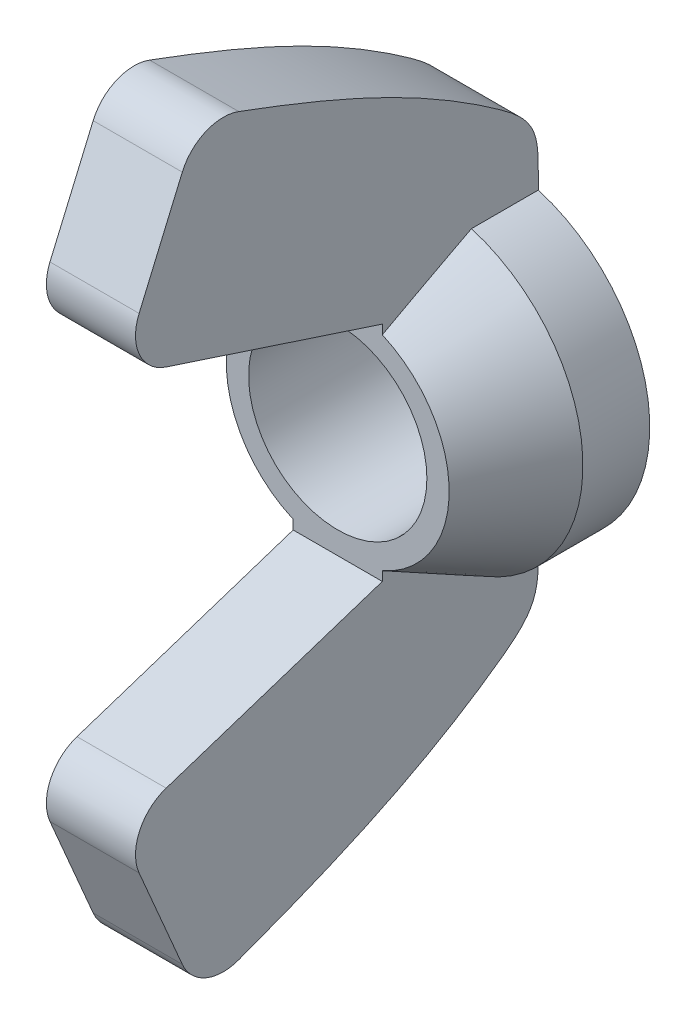
ISO-10303-21;
HEADER;
FILE_DESCRIPTION(('STEP AP214'),'2;1');
FILE_NAME('part.step','',(''),(''),'','','');
FILE_SCHEMA(('AUTOMOTIVE_DESIGN { 1 0 10303 214 1 1 1 1 }'));
ENDSEC;
DATA;
#1=APPLICATION_CONTEXT('core data for automotive mechanical design processes');
#2=APPLICATION_PROTOCOL_DEFINITION('international standard','automotive_design',2000,#1);
#3=PRODUCT_CONTEXT('',#1,'mechanical');
#4=PRODUCT('Part','Part','',(#3));
#5=PRODUCT_RELATED_PRODUCT_CATEGORY('part','',(#4));
#6=PRODUCT_DEFINITION_FORMATION('','',#4);
#7=PRODUCT_DEFINITION_CONTEXT('part definition',#1,'design');
#8=PRODUCT_DEFINITION('design','',#6,#7);
#9=PRODUCT_DEFINITION_SHAPE('','',#8);
#10=(LENGTH_UNIT() NAMED_UNIT(*) SI_UNIT(.MILLI.,.METRE.));
#11=(NAMED_UNIT(*) PLANE_ANGLE_UNIT() SI_UNIT($,.RADIAN.));
#12=(NAMED_UNIT(*) SI_UNIT($,.STERADIAN.) SOLID_ANGLE_UNIT());
#13=UNCERTAINTY_MEASURE_WITH_UNIT(LENGTH_MEASURE(1.E-05),#10,'distance_accuracy_value','');
#14=(GEOMETRIC_REPRESENTATION_CONTEXT(3) GLOBAL_UNCERTAINTY_ASSIGNED_CONTEXT((#13)) GLOBAL_UNIT_ASSIGNED_CONTEXT((#10,
#11,#12)) REPRESENTATION_CONTEXT('',''));
#15=CARTESIAN_POINT('',(0.,0.,0.));
#16=DIRECTION('',(0.,0.,1.));
#17=DIRECTION('',(1.,0.,0.));
#18=AXIS2_PLACEMENT_3D('',#15,#16,#17);
#19=CARTESIAN_POINT('',(0.,0.,5.55625));
#20=DIRECTION('',(0.,0.,-1.));
#21=DIRECTION('',(-1.,0.,0.));
#22=AXIS2_PLACEMENT_3D('',#19,#20,#21);
#23=CYLINDRICAL_SURFACE('',#22,5.55625);
#24=DIRECTION('',(0.,0.,-1.));
#25=VECTOR('',#24,1.);
#26=CARTESIAN_POINT('',(1.5875,-5.32463687142137,5.55625));
#27=LINE('',#26,#25);
#28=CARTESIAN_POINT('',(1.5875,-5.32463687142137,0.));
#29=VERTEX_POINT('',#28);
#30=CARTESIAN_POINT('',(1.5875,-5.32463687142137,2.38124999999998));
#31=VERTEX_POINT('',#30);
#32=EDGE_CURVE('E651',#29,#31,#27,.F.);
#33=ORIENTED_EDGE('',*,*,#32,.F.);
#34=CARTESIAN_POINT('',(0.,0.,0.));
#35=DIRECTION('',(0.,0.,1.));
#36=DIRECTION('',(1.,0.,0.));
#37=AXIS2_PLACEMENT_3D('',#34,#35,#36);
#38=CIRCLE('',#37,5.55625);
#39=CARTESIAN_POINT('',(1.5875,5.32463687142137,0.));
#40=VERTEX_POINT('',#39);
#41=EDGE_CURVE('E635',#29,#40,#38,.T.);
#42=ORIENTED_EDGE('',*,*,#41,.T.);
#43=DIRECTION('',(0.,0.,-1.));
#44=VECTOR('',#43,1.);
#45=CARTESIAN_POINT('',(1.5875,5.32463687142137,5.55625));
#46=LINE('',#45,#44);
#47=CARTESIAN_POINT('',(1.5875,5.32463687142137,2.38124999999998));
#48=VERTEX_POINT('',#47);
#49=EDGE_CURVE('E653',#40,#48,#46,.F.);
#50=ORIENTED_EDGE('',*,*,#49,.T.);
#51=CARTESIAN_POINT('',(0.,0.,2.38124999999998));
#52=DIRECTION('',(0.,0.,1.));
#53=DIRECTION('',(1.,0.,0.));
#54=AXIS2_PLACEMENT_3D('',#51,#52,#53);
#55=CIRCLE('',#54,5.55625);
#56=EDGE_CURVE('E569',#48,#31,#55,.F.);
#57=ORIENTED_EDGE('',*,*,#56,.T.);
#58=EDGE_LOOP('',(#33,#42,#50,#57));
#59=FACE_BOUND('',#58,.T.);
#60=ADVANCED_FACE('F360',(#59),#23,.T.);
#61=CARTESIAN_POINT('',(0.,0.,5.55625));
#62=DIRECTION('',(0.,0.,-1.));
#63=DIRECTION('',(-1.,0.,0.));
#64=AXIS2_PLACEMENT_3D('',#61,#62,#63);
#65=CONICAL_SURFACE('',#64,3.96875,0.463647609000804);
#66=CARTESIAN_POINT('',(0.,0.,5.55625));
#67=DIRECTION('',(0.,0.,1.));
#68=DIRECTION('',(1.,0.,0.));
#69=AXIS2_PLACEMENT_3D('',#66,#67,#68);
#70=CIRCLE('',#69,3.96875);
#71=CARTESIAN_POINT('',(1.5875,-3.6374194578712,5.55625));
#72=VERTEX_POINT('',#71);
#73=CARTESIAN_POINT('',(1.5875,3.6374194578712,5.55625));
#74=VERTEX_POINT('',#73);
#75=EDGE_CURVE('E634',#72,#74,#70,.T.);
#76=ORIENTED_EDGE('',*,*,#75,.F.);
#77=CARTESIAN_POINT('',(1.5875,-1.41472669564117,9.24093546213934));
#78=CARTESIAN_POINT('',(1.5875,-1.45171286215997,9.19170876585961));
#79=CARTESIAN_POINT('',(1.5875,-1.48819188522888,9.14210611052376));
#80=CARTESIAN_POINT('',(1.5875,-1.56026944038334,9.04227138607281));
#81=CARTESIAN_POINT('',(1.5875,-1.59586805244977,8.99203937476076));
#82=CARTESIAN_POINT('',(1.5875,-1.70153055985075,8.84060288113371));
#83=CARTESIAN_POINT('',(1.5875,-1.77048543480567,8.73862518766388));
#84=CARTESIAN_POINT('',(1.5875,-1.90612831795676,8.53329687234093));
#85=CARTESIAN_POINT('',(1.5875,-1.97281805067972,8.42994738222536));
#86=CARTESIAN_POINT('',(1.5875,-2.10449398806066,8.22215742572319));
#87=CARTESIAN_POINT('',(1.5875,-2.16948002586395,8.11771685386982));
#88=CARTESIAN_POINT('',(1.5875,-2.3622814591209,7.80342666192622));
#89=CARTESIAN_POINT('',(1.5875,-2.48810389608905,7.5923562834048));
#90=CARTESIAN_POINT('',(1.5875,-2.73628933012215,7.16813924153742));
#91=CARTESIAN_POINT('',(1.5875,-2.85865148565303,6.9549920897849));
#92=CARTESIAN_POINT('',(1.5875,-3.16280262322423,6.41815557880398));
#93=CARTESIAN_POINT('',(1.5875,-3.34303750071404,6.09358711581862));
#94=CARTESIAN_POINT('',(1.5875,-3.7000533844812,5.44260171728479));
#95=CARTESIAN_POINT('',(1.5875,-3.8768346727352,5.11618493547744));
#96=CARTESIAN_POINT('',(1.5875,-4.22821983708037,4.46183102784579));
#97=CARTESIAN_POINT('',(1.5875,-4.40282176809626,4.13389285866973));
#98=CARTESIAN_POINT('',(1.5875,-4.75038672073243,3.47714196939518));
#99=CARTESIAN_POINT('',(1.5875,-4.92334970827415,3.14832923129305));
#100=CARTESIAN_POINT('',(1.5875,-5.38192844698968,2.27269758192146));
#101=CARTESIAN_POINT('',(1.5875,-5.6664962633761,1.72533017525043));
#102=CARTESIAN_POINT('',(1.5875,-6.23355312114142,0.629524790508144));
#103=CARTESIAN_POINT('',(1.5875,-6.51604217145699,0.0810868170521298));
#104=CARTESIAN_POINT('',(1.5875,-7.07914136848831,-1.01559538166814));
#105=CARTESIAN_POINT('',(1.5875,-7.35975386506005,-1.56383840109212));
#106=CARTESIAN_POINT('',(1.5875,-7.91995427150124,-2.66084548362463));
#107=CARTESIAN_POINT('',(1.5875,-8.19954218481062,-3.20960954497602));
#108=CARTESIAN_POINT('',(1.5875,-8.47880827773166,-3.7585363482532));
#109=B_SPLINE_CURVE_WITH_KNOTS('',3,(#77,#78,#79,#80,#81,#82,#83,#84,#85,#86,#87,#88,#89,#90,
#91,#92,#93,#94,#95,#96,#97,#98,#99,#100,#101,#102,#103,#104,#105,#106,#107,#108),.UNSPECIFIED.,
.F.,.F.,(4,2,2,2,2,2,2,2,2,2,2,2,2,2,2,4),(0.,0.184709882298618,0.369402922538891,
0.738666698594669,1.10764273570486,1.47665477521974,2.21377691684384,2.95107680984983,
4.06479832082064,5.17842851602101,6.29299024956285,7.40757510755716,9.25832602981018,
11.1090689909865,12.9567213683566,14.8043675367427),.UNSPECIFIED.);
#110=EDGE_CURVE('E595',#72,#31,#109,.T.);
#111=ORIENTED_EDGE('',*,*,#110,.T.);
#112=ORIENTED_EDGE('',*,*,#56,.F.);
#113=CARTESIAN_POINT('',(1.5875,1.41472669564117,9.24093546213934));
#114=CARTESIAN_POINT('',(1.5875,1.45171286215997,9.19170876585961));
#115=CARTESIAN_POINT('',(1.5875,1.48819188522888,9.14210611052376));
#116=CARTESIAN_POINT('',(1.5875,1.56026944038334,9.04227138607281));
#117=CARTESIAN_POINT('',(1.5875,1.59586805244977,8.99203937476076));
#118=CARTESIAN_POINT('',(1.5875,1.70153055985075,8.84060288113371));
#119=CARTESIAN_POINT('',(1.5875,1.77048543480567,8.73862518766388));
#120=CARTESIAN_POINT('',(1.5875,1.90612831795676,8.53329687234093));
#121=CARTESIAN_POINT('',(1.5875,1.97281805067972,8.42994738222536));
#122=CARTESIAN_POINT('',(1.5875,2.10449398806066,8.22215742572319));
#123=CARTESIAN_POINT('',(1.5875,2.16948002586395,8.11771685386982));
#124=CARTESIAN_POINT('',(1.5875,2.3622814591209,7.80342666192622));
#125=CARTESIAN_POINT('',(1.5875,2.48810389608905,7.5923562834048));
#126=CARTESIAN_POINT('',(1.5875,2.73628933012215,7.16813924153742));
#127=CARTESIAN_POINT('',(1.5875,2.85865148565303,6.9549920897849));
#128=CARTESIAN_POINT('',(1.5875,3.16280262322423,6.41815557880398));
#129=CARTESIAN_POINT('',(1.5875,3.34303750071404,6.09358711581862));
#130=CARTESIAN_POINT('',(1.5875,3.7000533844812,5.44260171728479));
#131=CARTESIAN_POINT('',(1.5875,3.8768346727352,5.11618493547744));
#132=CARTESIAN_POINT('',(1.5875,4.22821983708037,4.46183102784579));
#133=CARTESIAN_POINT('',(1.5875,4.40282176809626,4.13389285866973));
#134=CARTESIAN_POINT('',(1.5875,4.75038672073243,3.47714196939518));
#135=CARTESIAN_POINT('',(1.5875,4.92334970827415,3.14832923129305));
#136=CARTESIAN_POINT('',(1.5875,5.38192844698968,2.27269758192146));
#137=CARTESIAN_POINT('',(1.5875,5.6664962633761,1.72533017525043));
#138=CARTESIAN_POINT('',(1.5875,6.23355312114142,0.629524790508144));
#139=CARTESIAN_POINT('',(1.5875,6.51604217145699,0.0810868170521298));
#140=CARTESIAN_POINT('',(1.5875,7.07914136848831,-1.01559538166814));
#141=CARTESIAN_POINT('',(1.5875,7.35975386506005,-1.56383840109212));
#142=CARTESIAN_POINT('',(1.5875,7.91995427150124,-2.66084548362463));
#143=CARTESIAN_POINT('',(1.5875,8.19954218481062,-3.20960954497602));
#144=CARTESIAN_POINT('',(1.5875,8.47880827773166,-3.7585363482532));
#145=B_SPLINE_CURVE_WITH_KNOTS('',3,(#113,#114,#115,#116,#117,#118,#119,#120,#121,#122,#123,
#124,#125,#126,#127,#128,#129,#130,#131,#132,#133,#134,#135,#136,#137,#138,#139,#140,#141,#142,
#143,#144),.UNSPECIFIED.,.F.,.F.,(4,2,2,2,2,2,2,2,2,2,2,2,2,2,2,4),(0.,0.184709882298618,
0.369402922538891,0.738666698594669,1.10764273570486,1.47665477521974,2.21377691684384,
2.95107680984983,4.06479832082064,5.17842851602101,6.29299024956285,7.40757510755716,
9.25832602981018,11.1090689909865,12.9567213683566,14.8043675367427),.UNSPECIFIED.);
#146=EDGE_CURVE('E568',#74,#48,#145,.T.);
#147=ORIENTED_EDGE('',*,*,#146,.F.);
#148=EDGE_LOOP('',(#76,#111,#112,#147));
#149=FACE_BOUND('',#148,.T.);
#150=ADVANCED_FACE('F582',(#149),#65,.T.);
#151=CARTESIAN_POINT('',(0.,0.,5.55625));
#152=DIRECTION('',(0.,0.,1.));
#153=DIRECTION('',(1.,0.,0.));
#154=AXIS2_PLACEMENT_3D('',#151,#152,#153);
#155=PLANE('',#154);
#156=DIRECTION('',(0.,-1.,0.));
#157=VECTOR('',#156,1.);
#158=CARTESIAN_POINT('',(1.5875,-3.96875,5.55625));
#159=LINE('',#158,#157);
#160=CARTESIAN_POINT('',(1.5875,-3.96875,5.55625));
#161=VERTEX_POINT('',#160);
#162=EDGE_CURVE('E709',#72,#161,#159,.T.);
#163=ORIENTED_EDGE('',*,*,#162,.F.);
#164=ORIENTED_EDGE('',*,*,#75,.T.);
#165=DIRECTION('',(0.,-1.,0.));
#166=VECTOR('',#165,1.);
#167=CARTESIAN_POINT('',(1.5875,3.96875,5.55625));
#168=LINE('',#167,#166);
#169=CARTESIAN_POINT('',(1.5875,3.96875,5.55625));
#170=VERTEX_POINT('',#169);
#171=EDGE_CURVE('E687',#170,#74,#168,.T.);
#172=ORIENTED_EDGE('',*,*,#171,.F.);
#173=DIRECTION('',(-1.,0.,0.));
#174=VECTOR('',#173,1.);
#175=CARTESIAN_POINT('',(1.5875,3.96875,5.55625));
#176=LINE('',#175,#174);
#177=CARTESIAN_POINT('',(-1.5875,3.96875,5.55625));
#178=VERTEX_POINT('',#177);
#179=EDGE_CURVE('E694',#170,#178,#176,.T.);
#180=ORIENTED_EDGE('',*,*,#179,.T.);
#181=DIRECTION('',(0.,-1.,0.));
#182=VECTOR('',#181,1.);
#183=CARTESIAN_POINT('',(-1.5875,3.96875,5.55625));
#184=LINE('',#183,#182);
#185=CARTESIAN_POINT('',(-1.5875,3.6374194578712,5.55625));
#186=VERTEX_POINT('',#185);
#187=EDGE_CURVE('E672',#178,#186,#184,.T.);
#188=ORIENTED_EDGE('',*,*,#187,.T.);
#189=CARTESIAN_POINT('',(-1.5875,-3.6374194578712,5.55625));
#190=VERTEX_POINT('',#189);
#191=EDGE_CURVE('E637',#186,#190,#70,.T.);
#192=ORIENTED_EDGE('',*,*,#191,.T.);
#193=DIRECTION('',(0.,-1.,0.));
#194=VECTOR('',#193,1.);
#195=CARTESIAN_POINT('',(-1.5875,-3.96875,5.55625));
#196=LINE('',#195,#194);
#197=CARTESIAN_POINT('',(-1.5875,-3.96875,5.55625));
#198=VERTEX_POINT('',#197);
#199=EDGE_CURVE('E517',#190,#198,#196,.T.);
#200=ORIENTED_EDGE('',*,*,#199,.T.);
#201=DIRECTION('',(-1.,0.,0.));
#202=VECTOR('',#201,1.);
#203=CARTESIAN_POINT('',(1.5875,-3.96875,5.55625));
#204=LINE('',#203,#202);
#205=EDGE_CURVE('E511',#161,#198,#204,.T.);
#206=ORIENTED_EDGE('',*,*,#205,.F.);
#207=EDGE_LOOP('',(#163,#164,#172,#180,#188,#192,#200,#206));
#208=FACE_BOUND('',#207,.T.);
#209=CARTESIAN_POINT('',(0.,0.,5.55625));
#210=DIRECTION('',(0.,0.,1.));
#211=DIRECTION('',(1.,0.,0.));
#212=AXIS2_PLACEMENT_3D('',#209,#210,#211);
#213=CIRCLE('',#212,3.175);
#214=CARTESIAN_POINT('',(3.175,0.,5.55625));
#215=VERTEX_POINT('',#214);
#216=EDGE_CURVE('E638',#215,#215,#213,.T.);
#217=ORIENTED_EDGE('',*,*,#216,.F.);
#218=EDGE_LOOP('',(#217));
#219=FACE_BOUND('',#218,.T.);
#220=ADVANCED_FACE('F621',(#208,#219),#155,.T.);
#221=CARTESIAN_POINT('',(0.,0.,0.));
#222=DIRECTION('',(0.,0.,1.));
#223=DIRECTION('',(1.,0.,0.));
#224=AXIS2_PLACEMENT_3D('',#221,#222,#223);
#225=PLANE('',#224);
#226=ORIENTED_EDGE('',*,*,#41,.F.);
#227=DIRECTION('',(0.,1.,0.));
#228=VECTOR('',#227,1.);
#229=CARTESIAN_POINT('',(1.5875,-5.55625,0.));
#230=LINE('',#229,#228);
#231=CARTESIAN_POINT('',(1.5875,-5.55625,0.));
#232=VERTEX_POINT('',#231);
#233=EDGE_CURVE('E509',#232,#29,#230,.T.);
#234=ORIENTED_EDGE('',*,*,#233,.F.);
#235=DIRECTION('',(-1.,0.,0.));
#236=VECTOR('',#235,1.);
#237=CARTESIAN_POINT('',(1.5875,-5.55625,0.));
#238=LINE('',#237,#236);
#239=CARTESIAN_POINT('',(-1.5875,-5.55625,0.));
#240=VERTEX_POINT('',#239);
#241=EDGE_CURVE('E493',#232,#240,#238,.T.);
#242=ORIENTED_EDGE('',*,*,#241,.T.);
#243=DIRECTION('',(0.,1.,0.));
#244=VECTOR('',#243,1.);
#245=CARTESIAN_POINT('',(-1.5875,-5.55625,0.));
#246=LINE('',#245,#244);
#247=CARTESIAN_POINT('',(-1.5875,-5.32463687142137,0.));
#248=VERTEX_POINT('',#247);
#249=EDGE_CURVE('E499',#240,#248,#246,.T.);
#250=ORIENTED_EDGE('',*,*,#249,.T.);
#251=CARTESIAN_POINT('',(-1.5875,5.32463687142137,0.));
#252=VERTEX_POINT('',#251);
#253=EDGE_CURVE('E630',#252,#248,#38,.T.);
#254=ORIENTED_EDGE('',*,*,#253,.F.);
#255=DIRECTION('',(0.,1.,0.));
#256=VECTOR('',#255,1.);
#257=CARTESIAN_POINT('',(-1.5875,5.55625,0.));
#258=LINE('',#257,#256);
#259=CARTESIAN_POINT('',(-1.5875,5.55625,0.));
#260=VERTEX_POINT('',#259);
#261=EDGE_CURVE('E674',#252,#260,#258,.T.);
#262=ORIENTED_EDGE('',*,*,#261,.T.);
#263=DIRECTION('',(-1.,0.,0.));
#264=VECTOR('',#263,1.);
#265=CARTESIAN_POINT('',(1.5875,5.55625,0.));
#266=LINE('',#265,#264);
#267=CARTESIAN_POINT('',(1.5875,5.55625,0.));
#268=VERTEX_POINT('',#267);
#269=EDGE_CURVE('E692',#268,#260,#266,.T.);
#270=ORIENTED_EDGE('',*,*,#269,.F.);
#271=DIRECTION('',(0.,1.,0.));
#272=VECTOR('',#271,1.);
#273=CARTESIAN_POINT('',(1.5875,5.55625,0.));
#274=LINE('',#273,#272);
#275=EDGE_CURVE('E690',#40,#268,#274,.T.);
#276=ORIENTED_EDGE('',*,*,#275,.F.);
#277=EDGE_LOOP('',(#226,#234,#242,#250,#254,#262,#270,#276));
#278=FACE_BOUND('',#277,.T.);
#279=CARTESIAN_POINT('',(0.,0.,0.));
#280=DIRECTION('',(0.,0.,1.));
#281=DIRECTION('',(1.,0.,0.));
#282=AXIS2_PLACEMENT_3D('',#279,#280,#281);
#283=CIRCLE('',#282,3.175);
#284=CARTESIAN_POINT('',(3.175,0.,0.));
#285=VERTEX_POINT('',#284);
#286=EDGE_CURVE('E698',#285,#285,#283,.T.);
#287=ORIENTED_EDGE('',*,*,#286,.T.);
#288=EDGE_LOOP('',(#287));
#289=FACE_BOUND('',#288,.T.);
#290=ADVANCED_FACE('F505',(#278,#289),#225,.F.);
#291=ORIENTED_EDGE('',*,*,#253,.T.);
#292=DIRECTION('',(0.,0.,-1.));
#293=VECTOR('',#292,1.);
#294=CARTESIAN_POINT('',(-1.5875,-5.32463687142137,5.55625));
#295=LINE('',#294,#293);
#296=CARTESIAN_POINT('',(-1.5875,-5.32463687142137,2.38124999999998));
#297=VERTEX_POINT('',#296);
#298=EDGE_CURVE('E510',#248,#297,#295,.F.);
#299=ORIENTED_EDGE('',*,*,#298,.T.);
#300=CARTESIAN_POINT('',(-1.5875,5.32463687142137,2.38124999999998));
#301=VERTEX_POINT('',#300);
#302=EDGE_CURVE('E642',#297,#301,#55,.F.);
#303=ORIENTED_EDGE('',*,*,#302,.T.);
#304=DIRECTION('',(0.,0.,-1.));
#305=VECTOR('',#304,1.);
#306=CARTESIAN_POINT('',(-1.5875,5.32463687142137,5.55625));
#307=LINE('',#306,#305);
#308=EDGE_CURVE('E632',#252,#301,#307,.F.);
#309=ORIENTED_EDGE('',*,*,#308,.F.);
#310=EDGE_LOOP('',(#291,#299,#303,#309));
#311=FACE_BOUND('',#310,.T.);
#312=ADVANCED_FACE('F362',(#311),#23,.T.);
#313=CARTESIAN_POINT('',(0.,0.,5.55625));
#314=DIRECTION('',(0.,0.,-1.));
#315=DIRECTION('',(-1.,0.,0.));
#316=AXIS2_PLACEMENT_3D('',#313,#314,#315);
#317=CYLINDRICAL_SURFACE('',#316,3.175);
#318=ORIENTED_EDGE('',*,*,#216,.T.);
#319=EDGE_LOOP('',(#318));
#320=FACE_BOUND('',#319,.T.);
#321=ORIENTED_EDGE('',*,*,#286,.F.);
#322=EDGE_LOOP('',(#321));
#323=FACE_BOUND('',#322,.T.);
#324=ADVANCED_FACE('F580',(#320,#323),#317,.F.);
#325=CARTESIAN_POINT('',(-1.5875,-1.41472669564117,9.24093546213934));
#326=CARTESIAN_POINT('',(-1.5875,-1.45171286215997,9.19170876585961));
#327=CARTESIAN_POINT('',(-1.5875,-1.48819188522888,9.14210611052376));
#328=CARTESIAN_POINT('',(-1.5875,-1.56026944038334,9.04227138607281));
#329=CARTESIAN_POINT('',(-1.5875,-1.59586805244977,8.99203937476076));
#330=CARTESIAN_POINT('',(-1.5875,-1.70153055985075,8.84060288113371));
#331=CARTESIAN_POINT('',(-1.5875,-1.77048543480567,8.73862518766388));
#332=CARTESIAN_POINT('',(-1.5875,-1.90612831795676,8.53329687234093));
#333=CARTESIAN_POINT('',(-1.5875,-1.97281805067972,8.42994738222536));
#334=CARTESIAN_POINT('',(-1.5875,-2.10449398806066,8.22215742572319));
#335=CARTESIAN_POINT('',(-1.5875,-2.16948002586395,8.11771685386982));
#336=CARTESIAN_POINT('',(-1.5875,-2.3622814591209,7.80342666192622));
#337=CARTESIAN_POINT('',(-1.5875,-2.48810389608905,7.5923562834048));
#338=CARTESIAN_POINT('',(-1.5875,-2.73628933012215,7.16813924153742));
#339=CARTESIAN_POINT('',(-1.5875,-2.85865148565303,6.9549920897849));
#340=CARTESIAN_POINT('',(-1.5875,-3.16280262322423,6.41815557880398));
#341=CARTESIAN_POINT('',(-1.5875,-3.34303750071404,6.09358711581862));
#342=CARTESIAN_POINT('',(-1.5875,-3.7000533844812,5.44260171728479));
#343=CARTESIAN_POINT('',(-1.5875,-3.8768346727352,5.11618493547744));
#344=CARTESIAN_POINT('',(-1.5875,-4.22821983708037,4.46183102784579));
#345=CARTESIAN_POINT('',(-1.5875,-4.40282176809626,4.13389285866973));
#346=CARTESIAN_POINT('',(-1.5875,-4.75038672073243,3.47714196939518));
#347=CARTESIAN_POINT('',(-1.5875,-4.92334970827415,3.14832923129305));
#348=CARTESIAN_POINT('',(-1.5875,-5.38192844698968,2.27269758192146));
#349=CARTESIAN_POINT('',(-1.5875,-5.6664962633761,1.72533017525043));
#350=CARTESIAN_POINT('',(-1.5875,-6.23355312114142,0.629524790508144));
#351=CARTESIAN_POINT('',(-1.5875,-6.51604217145699,0.0810868170521298));
#352=CARTESIAN_POINT('',(-1.5875,-7.07914136848831,-1.01559538166814));
#353=CARTESIAN_POINT('',(-1.5875,-7.35975386506005,-1.56383840109212));
#354=CARTESIAN_POINT('',(-1.5875,-7.91995427150124,-2.66084548362463));
#355=CARTESIAN_POINT('',(-1.5875,-8.19954218481062,-3.20960954497602));
#356=CARTESIAN_POINT('',(-1.5875,-8.47880827773166,-3.7585363482532));
#357=B_SPLINE_CURVE_WITH_KNOTS('',3,(#325,#326,#327,#328,#329,#330,#331,#332,#333,#334,#335,
#336,#337,#338,#339,#340,#341,#342,#343,#344,#345,#346,#347,#348,#349,#350,#351,#352,#353,#354,
#355,#356),.UNSPECIFIED.,.F.,.F.,(4,2,2,2,2,2,2,2,2,2,2,2,2,2,2,4),(0.,0.184709882298618,
0.369402922538891,0.738666698594669,1.10764273570486,1.47665477521974,2.21377691684384,
2.95107680984983,4.06479832082064,5.17842851602101,6.29299024956285,7.40757510755716,
9.25832602981018,11.1090689909865,12.9567213683566,14.8043675367427),.UNSPECIFIED.);
#358=EDGE_CURVE('E590',#190,#297,#357,.T.);
#359=ORIENTED_EDGE('',*,*,#358,.F.);
#360=ORIENTED_EDGE('',*,*,#191,.F.);
#361=CARTESIAN_POINT('',(-1.5875,1.41472669564117,9.24093546213934));
#362=CARTESIAN_POINT('',(-1.5875,1.45171286215997,9.19170876585961));
#363=CARTESIAN_POINT('',(-1.5875,1.48819188522888,9.14210611052376));
#364=CARTESIAN_POINT('',(-1.5875,1.56026944038334,9.04227138607281));
#365=CARTESIAN_POINT('',(-1.5875,1.59586805244977,8.99203937476076));
#366=CARTESIAN_POINT('',(-1.5875,1.70153055985075,8.84060288113371));
#367=CARTESIAN_POINT('',(-1.5875,1.77048543480567,8.73862518766388));
#368=CARTESIAN_POINT('',(-1.5875,1.90612831795676,8.53329687234093));
#369=CARTESIAN_POINT('',(-1.5875,1.97281805067972,8.42994738222536));
#370=CARTESIAN_POINT('',(-1.5875,2.10449398806066,8.22215742572319));
#371=CARTESIAN_POINT('',(-1.5875,2.16948002586395,8.11771685386982));
#372=CARTESIAN_POINT('',(-1.5875,2.3622814591209,7.80342666192622));
#373=CARTESIAN_POINT('',(-1.5875,2.48810389608905,7.5923562834048));
#374=CARTESIAN_POINT('',(-1.5875,2.73628933012215,7.16813924153742));
#375=CARTESIAN_POINT('',(-1.5875,2.85865148565303,6.9549920897849));
#376=CARTESIAN_POINT('',(-1.5875,3.16280262322423,6.41815557880398));
#377=CARTESIAN_POINT('',(-1.5875,3.34303750071404,6.09358711581862));
#378=CARTESIAN_POINT('',(-1.5875,3.7000533844812,5.44260171728479));
#379=CARTESIAN_POINT('',(-1.5875,3.8768346727352,5.11618493547744));
#380=CARTESIAN_POINT('',(-1.5875,4.22821983708037,4.46183102784579));
#381=CARTESIAN_POINT('',(-1.5875,4.40282176809626,4.13389285866973));
#382=CARTESIAN_POINT('',(-1.5875,4.75038672073243,3.47714196939518));
#383=CARTESIAN_POINT('',(-1.5875,4.92334970827415,3.14832923129305));
#384=CARTESIAN_POINT('',(-1.5875,5.38192844698968,2.27269758192146));
#385=CARTESIAN_POINT('',(-1.5875,5.6664962633761,1.72533017525043));
#386=CARTESIAN_POINT('',(-1.5875,6.23355312114142,0.629524790508144));
#387=CARTESIAN_POINT('',(-1.5875,6.51604217145699,0.0810868170521298));
#388=CARTESIAN_POINT('',(-1.5875,7.07914136848831,-1.01559538166814));
#389=CARTESIAN_POINT('',(-1.5875,7.35975386506005,-1.56383840109212));
#390=CARTESIAN_POINT('',(-1.5875,7.91995427150124,-2.66084548362463));
#391=CARTESIAN_POINT('',(-1.5875,8.19954218481062,-3.20960954497602));
#392=CARTESIAN_POINT('',(-1.5875,8.47880827773166,-3.7585363482532));
#393=B_SPLINE_CURVE_WITH_KNOTS('',3,(#361,#362,#363,#364,#365,#366,#367,#368,#369,#370,#371,
#372,#373,#374,#375,#376,#377,#378,#379,#380,#381,#382,#383,#384,#385,#386,#387,#388,#389,#390,
#391,#392),.UNSPECIFIED.,.F.,.F.,(4,2,2,2,2,2,2,2,2,2,2,2,2,2,2,4),(0.,0.184709882298618,
0.369402922538891,0.738666698594669,1.10764273570486,1.47665477521974,2.21377691684384,
2.95107680984983,4.06479832082064,5.17842851602101,6.29299024956285,7.40757510755716,
9.25832602981018,11.1090689909865,12.9567213683566,14.8043675367427),.UNSPECIFIED.);
#394=EDGE_CURVE('E560',#186,#301,#393,.T.);
#395=ORIENTED_EDGE('',*,*,#394,.T.);
#396=ORIENTED_EDGE('',*,*,#302,.F.);
#397=EDGE_LOOP('',(#359,#360,#395,#396));
#398=FACE_BOUND('',#397,.T.);
#399=ADVANCED_FACE('F575',(#398),#65,.T.);
#400=CARTESIAN_POINT('',(1.5875,10.7230183359189,5.08650333879784));
#401=DIRECTION('',(1.,0.,0.));
#402=DIRECTION('',(0.,0.,-1.));
#403=AXIS2_PLACEMENT_3D('',#400,#401,#402);
#404=PLANE('',#403);
#405=CARTESIAN_POINT('',(1.5875,5.55625,0.));
#406=CARTESIAN_POINT('',(1.5875,6.12322839151743,0.));
#407=CARTESIAN_POINT('',(1.5875,7.40827137241223,-0.0688971104777768));
#408=CARTESIAN_POINT('',(1.5875,10.7422308950057,4.26621448536075));
#409=CARTESIAN_POINT('',(1.5875,12.2737924800859,8.45478137060782));
#410=CARTESIAN_POINT('',(1.5875,13.6018211540958,12.0867195053875));
#411=B_SPLINE_CURVE_WITH_KNOTS('',3,(#405,#406,#407,#408,#409,#410),.UNSPECIFIED.,.F.,.F.,(4,1,
1,4),(0.,0.111227895501624,0.229338962969514,1.),.UNSPECIFIED.);
#412=CARTESIAN_POINT('',(1.5875,13.0806445284822,10.6684449563426));
#413=VERTEX_POINT('',#412);
#414=EDGE_CURVE('E675',#268,#413,#411,.T.);
#415=ORIENTED_EDGE('',*,*,#414,.T.);
#416=CARTESIAN_POINT('',(1.5875,11.5923298536055,11.2207815190892));
#417=DIRECTION('',(1.,0.,0.));
#418=DIRECTION('',(0.,0.,-1.));
#419=AXIS2_PLACEMENT_3D('',#416,#417,#418);
#420=CIRCLE('',#419,1.5875);
#421=CARTESIAN_POINT('',(1.5875,12.2176767400999,12.6799242542429));
#422=VERTEX_POINT('',#421);
#423=EDGE_CURVE('E368',#413,#422,#420,.T.);
#424=ORIENTED_EDGE('',*,*,#423,.T.);
#425=DIRECTION('',(0.,-0.919145030018058,0.393919298579167));
#426=VECTOR('',#425,1.);
#427=CARTESIAN_POINT('',(1.5875,13.6018211540958,12.0867195053875));
#428=LINE('',#427,#426);
#429=CARTESIAN_POINT('',(1.5875,8.62884780814563,14.217993796509));
#430=VERTEX_POINT('',#429);
#431=EDGE_CURVE('E680',#422,#430,#428,.T.);
#432=ORIENTED_EDGE('',*,*,#431,.T.);
#433=CARTESIAN_POINT('',(1.5875,8.0035009216512,12.7588510613553));
#434=DIRECTION('',(1.,0.,0.));
#435=DIRECTION('',(0.,0.,-1.));
#436=AXIS2_PLACEMENT_3D('',#433,#434,#435);
#437=CIRCLE('',#436,1.5875);
#438=CARTESIAN_POINT('',(1.5875,6.49516204177853,13.2538965880137));
#439=VERTEX_POINT('',#438);
#440=EDGE_CURVE('E375',#430,#439,#437,.T.);
#441=ORIENTED_EDGE('',*,*,#440,.T.);
#442=DIRECTION('',(0.,-0.311839701832031,-0.950134727478851));
#443=VECTOR('',#442,1.);
#444=CARTESIAN_POINT('',(1.5875,7.03567884590425,14.9007804946124));
#445=LINE('',#444,#443);
#446=EDGE_CURVE('E685',#439,#170,#445,.T.);
#447=ORIENTED_EDGE('',*,*,#446,.T.);
#448=ORIENTED_EDGE('',*,*,#171,.T.);
#449=ORIENTED_EDGE('',*,*,#146,.T.);
#450=ORIENTED_EDGE('',*,*,#49,.F.);
#451=ORIENTED_EDGE('',*,*,#275,.T.);
#452=EDGE_LOOP('',(#415,#424,#432,#441,#447,#448,#449,#450,#451));
#453=FACE_BOUND('',#452,.T.);
#454=ADVANCED_FACE('F555',(#453),#404,.T.);
#455=CARTESIAN_POINT('',(-1.5875,10.7230183359189,5.08650333879784));
#456=DIRECTION('',(1.,0.,0.));
#457=DIRECTION('',(0.,0.,-1.));
#458=AXIS2_PLACEMENT_3D('',#455,#456,#457);
#459=PLANE('',#458);
#460=DIRECTION('',(0.,-0.919145030018058,0.393919298579167));
#461=VECTOR('',#460,1.);
#462=CARTESIAN_POINT('',(-1.5875,13.6018211540958,12.0867195053875));
#463=LINE('',#462,#461);
#464=CARTESIAN_POINT('',(-1.5875,12.2176767400999,12.6799242542429));
#465=VERTEX_POINT('',#464);
#466=CARTESIAN_POINT('',(-1.5875,8.62884780814563,14.217993796509));
#467=VERTEX_POINT('',#466);
#468=EDGE_CURVE('E659',#465,#467,#463,.T.);
#469=ORIENTED_EDGE('',*,*,#468,.F.);
#470=CARTESIAN_POINT('',(-1.5875,11.5923298536055,11.2207815190892));
#471=DIRECTION('',(1.,0.,0.));
#472=DIRECTION('',(0.,0.,-1.));
#473=AXIS2_PLACEMENT_3D('',#470,#471,#472);
#474=CIRCLE('',#473,1.5875);
#475=CARTESIAN_POINT('',(-1.5875,13.0806445284822,10.6684449563426));
#476=VERTEX_POINT('',#475);
#477=EDGE_CURVE('E746',#465,#476,#474,.F.);
#478=ORIENTED_EDGE('',*,*,#477,.T.);
#479=CARTESIAN_POINT('',(-1.5875,5.55625,0.));
#480=CARTESIAN_POINT('',(-1.5875,6.12322839151743,0.));
#481=CARTESIAN_POINT('',(-1.5875,7.40827137241223,-0.0688971104777768));
#482=CARTESIAN_POINT('',(-1.5875,10.7422308950057,4.26621448536075));
#483=CARTESIAN_POINT('',(-1.5875,12.2737924800859,8.45478137060782));
#484=CARTESIAN_POINT('',(-1.5875,13.6018211540958,12.0867195053875));
#485=B_SPLINE_CURVE_WITH_KNOTS('',3,(#479,#480,#481,#482,#483,#484),.UNSPECIFIED.,.F.,.F.,(4,1,
1,4),(0.,0.111227895501624,0.229338962969514,1.),.UNSPECIFIED.);
#486=EDGE_CURVE('E657',#260,#476,#485,.T.);
#487=ORIENTED_EDGE('',*,*,#486,.F.);
#488=ORIENTED_EDGE('',*,*,#261,.F.);
#489=ORIENTED_EDGE('',*,*,#308,.T.);
#490=ORIENTED_EDGE('',*,*,#394,.F.);
#491=ORIENTED_EDGE('',*,*,#187,.F.);
#492=DIRECTION('',(0.,-0.311839701832031,-0.950134727478851));
#493=VECTOR('',#492,1.);
#494=CARTESIAN_POINT('',(-1.5875,7.03567884590425,14.9007804946124));
#495=LINE('',#494,#493);
#496=CARTESIAN_POINT('',(-1.5875,6.49516204177853,13.2538965880137));
#497=VERTEX_POINT('',#496);
#498=EDGE_CURVE('E670',#497,#178,#495,.T.);
#499=ORIENTED_EDGE('',*,*,#498,.F.);
#500=CARTESIAN_POINT('',(-1.5875,8.0035009216512,12.7588510613553));
#501=DIRECTION('',(1.,0.,0.));
#502=DIRECTION('',(0.,0.,-1.));
#503=AXIS2_PLACEMENT_3D('',#500,#501,#502);
#504=CIRCLE('',#503,1.5875);
#505=EDGE_CURVE('E744',#497,#467,#504,.F.);
#506=ORIENTED_EDGE('',*,*,#505,.T.);
#507=EDGE_LOOP('',(#469,#478,#487,#488,#489,#490,#491,#499,#506));
#508=FACE_BOUND('',#507,.T.);
#509=ADVANCED_FACE('F550',(#508),#459,.F.);
#510=DIRECTION('',(-1.,0.,0.));
#511=VECTOR('',#510,1.);
#512=SURFACE_OF_LINEAR_EXTRUSION('',#411,#511);
#513=ORIENTED_EDGE('',*,*,#486,.T.);
#514=DIRECTION('',(-1.,0.,0.));
#515=VECTOR('',#514,1.);
#516=CARTESIAN_POINT('',(-1.5875,13.0806445284822,10.6684449563426));
#517=LINE('',#516,#515);
#518=EDGE_CURVE('E383',#476,#413,#517,.F.);
#519=ORIENTED_EDGE('',*,*,#518,.T.);
#520=ORIENTED_EDGE('',*,*,#414,.F.);
#521=ORIENTED_EDGE('',*,*,#269,.T.);
#522=EDGE_LOOP('',(#513,#519,#520,#521));
#523=FACE_BOUND('',#522,.T.);
#524=ADVANCED_FACE('F554',(#523),#512,.F.);
#525=CARTESIAN_POINT('',(1.5875,13.6018211540958,12.0867195053875));
#526=DIRECTION('',(0.,-0.393919298579167,-0.919145030018058));
#527=DIRECTION('',(0.,0.919145030018058,-0.393919298579167));
#528=AXIS2_PLACEMENT_3D('',#525,#526,#527);
#529=PLANE('',#528);
#530=ORIENTED_EDGE('',*,*,#431,.F.);
#531=DIRECTION('',(-1.,0.,0.));
#532=VECTOR('',#531,1.);
#533=CARTESIAN_POINT('',(1.5875,12.2176767400999,12.6799242542429));
#534=LINE('',#533,#532);
#535=EDGE_CURVE('E741',#422,#465,#534,.T.);
#536=ORIENTED_EDGE('',*,*,#535,.T.);
#537=ORIENTED_EDGE('',*,*,#468,.T.);
#538=DIRECTION('',(-1.,0.,0.));
#539=VECTOR('',#538,1.);
#540=CARTESIAN_POINT('',(1.5875,8.62884780814563,14.217993796509));
#541=LINE('',#540,#539);
#542=EDGE_CURVE('E739',#467,#430,#541,.F.);
#543=ORIENTED_EDGE('',*,*,#542,.T.);
#544=EDGE_LOOP('',(#530,#536,#537,#543));
#545=FACE_BOUND('',#544,.T.);
#546=ADVANCED_FACE('F613',(#545),#529,.F.);
#547=CARTESIAN_POINT('',(1.5875,7.03567884590425,14.9007804946124));
#548=DIRECTION('',(0.,0.950134727478851,-0.311839701832031));
#549=DIRECTION('',(0.,0.311839701832031,0.950134727478851));
#550=AXIS2_PLACEMENT_3D('',#547,#548,#549);
#551=PLANE('',#550);
#552=ORIENTED_EDGE('',*,*,#446,.F.);
#553=DIRECTION('',(-1.,0.,0.));
#554=VECTOR('',#553,1.);
#555=CARTESIAN_POINT('',(1.5875,6.49516204177853,13.2538965880137));
#556=LINE('',#555,#554);
#557=EDGE_CURVE('E11',#439,#497,#556,.T.);
#558=ORIENTED_EDGE('',*,*,#557,.T.);
#559=ORIENTED_EDGE('',*,*,#498,.T.);
#560=ORIENTED_EDGE('',*,*,#179,.F.);
#561=EDGE_LOOP('',(#552,#558,#559,#560));
#562=FACE_BOUND('',#561,.T.);
#563=ADVANCED_FACE('F608',(#562),#551,.F.);
#564=CARTESIAN_POINT('',(1.5875,-10.7230183359189,5.08650333879784));
#565=DIRECTION('',(-1.,0.,0.));
#566=DIRECTION('',(0.,0.,1.));
#567=AXIS2_PLACEMENT_3D('',#564,#565,#566);
#568=PLANE('',#567);
#569=DIRECTION('',(0.,-0.919145030018058,-0.393919298579167));
#570=VECTOR('',#569,1.);
#571=CARTESIAN_POINT('',(1.5875,-13.6018211540958,12.0867195053875));
#572=LINE('',#571,#570);
#573=CARTESIAN_POINT('',(1.5875,-8.62884780814563,14.217993796509));
#574=VERTEX_POINT('',#573);
#575=CARTESIAN_POINT('',(1.5875,-12.2176767400999,12.6799242542429));
#576=VERTEX_POINT('',#575);
#577=EDGE_CURVE('E528',#574,#576,#572,.T.);
#578=ORIENTED_EDGE('',*,*,#577,.T.);
#579=CARTESIAN_POINT('',(1.5875,-11.5923298536055,11.2207815190892));
#580=DIRECTION('',(-1.,0.,0.));
#581=DIRECTION('',(0.,0.,1.));
#582=AXIS2_PLACEMENT_3D('',#579,#580,#581);
#583=CIRCLE('',#582,1.5875);
#584=CARTESIAN_POINT('',(1.5875,-13.0806445284821,10.6684449563426));
#585=VERTEX_POINT('',#584);
#586=EDGE_CURVE('E735',#576,#585,#583,.F.);
#587=ORIENTED_EDGE('',*,*,#586,.T.);
#588=CARTESIAN_POINT('',(1.5875,-13.6018211540958,12.0867195053875));
#589=CARTESIAN_POINT('',(1.5875,-12.2737924800859,8.45478137060782));
#590=CARTESIAN_POINT('',(1.5875,-10.7422308950057,4.26621448536075));
#591=CARTESIAN_POINT('',(1.5875,-7.40827137241223,-0.0688971104777767));
#592=CARTESIAN_POINT('',(1.5875,-6.12322839151743,0.));
#593=CARTESIAN_POINT('',(1.5875,-5.55625,0.));
#594=B_SPLINE_CURVE_WITH_KNOTS('',3,(#588,#589,#590,#591,#592,#593),.UNSPECIFIED.,.F.,.F.,(4,1,
1,4),(0.,0.770661037030486,0.888772104498376,1.),.UNSPECIFIED.);
#595=EDGE_CURVE('E531',#585,#232,#594,.T.);
#596=ORIENTED_EDGE('',*,*,#595,.T.);
#597=ORIENTED_EDGE('',*,*,#233,.T.);
#598=ORIENTED_EDGE('',*,*,#32,.T.);
#599=ORIENTED_EDGE('',*,*,#110,.F.);
#600=ORIENTED_EDGE('',*,*,#162,.T.);
#601=DIRECTION('',(0.,-0.311839701832031,0.950134727478851));
#602=VECTOR('',#601,1.);
#603=CARTESIAN_POINT('',(1.5875,-7.03567884590425,14.9007804946124));
#604=LINE('',#603,#602);
#605=CARTESIAN_POINT('',(1.5875,-6.49516204177853,13.2538965880137));
#606=VERTEX_POINT('',#605);
#607=EDGE_CURVE('E713',#161,#606,#604,.T.);
#608=ORIENTED_EDGE('',*,*,#607,.T.);
#609=CARTESIAN_POINT('',(1.5875,-8.0035009216512,12.7588510613553));
#610=DIRECTION('',(-1.,0.,0.));
#611=DIRECTION('',(0.,0.,1.));
#612=AXIS2_PLACEMENT_3D('',#609,#610,#611);
#613=CIRCLE('',#612,1.5875);
#614=EDGE_CURVE('E733',#606,#574,#613,.F.);
#615=ORIENTED_EDGE('',*,*,#614,.T.);
#616=EDGE_LOOP('',(#578,#587,#596,#597,#598,#599,#600,#608,#615));
#617=FACE_BOUND('',#616,.T.);
#618=ADVANCED_FACE('F603',(#617),#568,.F.);
#619=CARTESIAN_POINT('',(-1.5875,-10.7230183359189,5.08650333879784));
#620=DIRECTION('',(-1.,0.,0.));
#621=DIRECTION('',(0.,0.,1.));
#622=AXIS2_PLACEMENT_3D('',#619,#620,#621);
#623=PLANE('',#622);
#624=CARTESIAN_POINT('',(-1.5875,-13.6018211540958,12.0867195053875));
#625=CARTESIAN_POINT('',(-1.5875,-12.2737924800859,8.45478137060782));
#626=CARTESIAN_POINT('',(-1.5875,-10.7422308950057,4.26621448536075));
#627=CARTESIAN_POINT('',(-1.5875,-7.40827137241223,-0.0688971104777767));
#628=CARTESIAN_POINT('',(-1.5875,-6.12322839151743,0.));
#629=CARTESIAN_POINT('',(-1.5875,-5.55625,0.));
#630=B_SPLINE_CURVE_WITH_KNOTS('',3,(#624,#625,#626,#627,#628,#629),.UNSPECIFIED.,.F.,.F.,(4,1,
1,4),(0.,0.770661037030486,0.888772104498376,1.),.UNSPECIFIED.);
#631=CARTESIAN_POINT('',(-1.5875,-13.0806445284821,10.6684449563426));
#632=VERTEX_POINT('',#631);
#633=EDGE_CURVE('E489',#632,#240,#630,.T.);
#634=ORIENTED_EDGE('',*,*,#633,.F.);
#635=CARTESIAN_POINT('',(-1.5875,-11.5923298536055,11.2207815190892));
#636=DIRECTION('',(-1.,0.,0.));
#637=DIRECTION('',(0.,0.,1.));
#638=AXIS2_PLACEMENT_3D('',#635,#636,#637);
#639=CIRCLE('',#638,1.5875);
#640=CARTESIAN_POINT('',(-1.5875,-12.2176767400999,12.6799242542429));
#641=VERTEX_POINT('',#640);
#642=EDGE_CURVE('E725',#632,#641,#639,.T.);
#643=ORIENTED_EDGE('',*,*,#642,.T.);
#644=DIRECTION('',(0.,-0.919145030018058,-0.393919298579167));
#645=VECTOR('',#644,1.);
#646=CARTESIAN_POINT('',(-1.5875,-13.6018211540958,12.0867195053875));
#647=LINE('',#646,#645);
#648=CARTESIAN_POINT('',(-1.5875,-8.62884780814563,14.217993796509));
#649=VERTEX_POINT('',#648);
#650=EDGE_CURVE('E500',#649,#641,#647,.T.);
#651=ORIENTED_EDGE('',*,*,#650,.F.);
#652=CARTESIAN_POINT('',(-1.5875,-8.0035009216512,12.7588510613553));
#653=DIRECTION('',(-1.,0.,0.));
#654=DIRECTION('',(0.,0.,1.));
#655=AXIS2_PLACEMENT_3D('',#652,#653,#654);
#656=CIRCLE('',#655,1.5875);
#657=CARTESIAN_POINT('',(-1.5875,-6.49516204177853,13.2538965880137));
#658=VERTEX_POINT('',#657);
#659=EDGE_CURVE('E720',#649,#658,#656,.T.);
#660=ORIENTED_EDGE('',*,*,#659,.T.);
#661=DIRECTION('',(0.,-0.311839701832031,0.950134727478851));
#662=VECTOR('',#661,1.);
#663=CARTESIAN_POINT('',(-1.5875,-7.03567884590425,14.9007804946124));
#664=LINE('',#663,#662);
#665=EDGE_CURVE('E520',#198,#658,#664,.T.);
#666=ORIENTED_EDGE('',*,*,#665,.F.);
#667=ORIENTED_EDGE('',*,*,#199,.F.);
#668=ORIENTED_EDGE('',*,*,#358,.T.);
#669=ORIENTED_EDGE('',*,*,#298,.F.);
#670=ORIENTED_EDGE('',*,*,#249,.F.);
#671=EDGE_LOOP('',(#634,#643,#651,#660,#666,#667,#668,#669,#670));
#672=FACE_BOUND('',#671,.T.);
#673=ADVANCED_FACE('F514',(#672),#623,.T.);
#674=CARTESIAN_POINT('',(1.5875,-13.6018211540958,12.0867195053875));
#675=DIRECTION('',(0.,0.393919298579167,-0.919145030018058));
#676=DIRECTION('',(0.,0.919145030018058,0.393919298579167));
#677=AXIS2_PLACEMENT_3D('',#674,#675,#676);
#678=PLANE('',#677);
#679=ORIENTED_EDGE('',*,*,#650,.T.);
#680=DIRECTION('',(-1.,0.,0.));
#681=VECTOR('',#680,1.);
#682=CARTESIAN_POINT('',(1.5875,-12.2176767400999,12.6799242542429));
#683=LINE('',#682,#681);
#684=EDGE_CURVE('E731',#641,#576,#683,.F.);
#685=ORIENTED_EDGE('',*,*,#684,.T.);
#686=ORIENTED_EDGE('',*,*,#577,.F.);
#687=DIRECTION('',(-1.,0.,0.));
#688=VECTOR('',#687,1.);
#689=CARTESIAN_POINT('',(1.5875,-8.62884780814563,14.217993796509));
#690=LINE('',#689,#688);
#691=EDGE_CURVE('E727',#574,#649,#690,.T.);
#692=ORIENTED_EDGE('',*,*,#691,.T.);
#693=EDGE_LOOP('',(#679,#685,#686,#692));
#694=FACE_BOUND('',#693,.T.);
#695=ADVANCED_FACE('F545',(#694),#678,.F.);
#696=DIRECTION('',(-1.,0.,0.));
#697=VECTOR('',#696,1.);
#698=SURFACE_OF_LINEAR_EXTRUSION('',#594,#697);
#699=ORIENTED_EDGE('',*,*,#595,.F.);
#700=DIRECTION('',(-1.,0.,0.));
#701=VECTOR('',#700,1.);
#702=CARTESIAN_POINT('',(1.5875,-13.0806445284821,10.6684449563426));
#703=LINE('',#702,#701);
#704=EDGE_CURVE('E496',#585,#632,#703,.T.);
#705=ORIENTED_EDGE('',*,*,#704,.T.);
#706=ORIENTED_EDGE('',*,*,#633,.T.);
#707=ORIENTED_EDGE('',*,*,#241,.F.);
#708=EDGE_LOOP('',(#699,#705,#706,#707));
#709=FACE_BOUND('',#708,.T.);
#710=ADVANCED_FACE('F492',(#709),#698,.F.);
#711=CARTESIAN_POINT('',(1.5875,-7.03567884590425,14.9007804946124));
#712=DIRECTION('',(0.,-0.950134727478851,-0.311839701832031));
#713=DIRECTION('',(0.,0.311839701832031,-0.950134727478851));
#714=AXIS2_PLACEMENT_3D('',#711,#712,#713);
#715=PLANE('',#714);
#716=ORIENTED_EDGE('',*,*,#665,.T.);
#717=DIRECTION('',(-1.,0.,0.));
#718=VECTOR('',#717,1.);
#719=CARTESIAN_POINT('',(1.5875,-6.49516204177853,13.2538965880137));
#720=LINE('',#719,#718);
#721=EDGE_CURVE('E737',#658,#606,#720,.F.);
#722=ORIENTED_EDGE('',*,*,#721,.T.);
#723=ORIENTED_EDGE('',*,*,#607,.F.);
#724=ORIENTED_EDGE('',*,*,#205,.T.);
#725=EDGE_LOOP('',(#716,#722,#723,#724));
#726=FACE_BOUND('',#725,.T.);
#727=ADVANCED_FACE('F544',(#726),#715,.F.);
#728=CARTESIAN_POINT('',(0.,-11.5923298536055,11.2207815190892));
#729=DIRECTION('',(-1.,0.,0.));
#730=DIRECTION('',(0.,0.,1.));
#731=AXIS2_PLACEMENT_3D('',#728,#729,#730);
#732=CYLINDRICAL_SURFACE('',#731,1.5875);
#733=ORIENTED_EDGE('',*,*,#586,.F.);
#734=ORIENTED_EDGE('',*,*,#684,.F.);
#735=ORIENTED_EDGE('',*,*,#642,.F.);
#736=ORIENTED_EDGE('',*,*,#704,.F.);
#737=EDGE_LOOP('',(#733,#734,#735,#736));
#738=FACE_BOUND('',#737,.T.);
#739=ADVANCED_FACE('F604',(#738),#732,.T.);
#740=CARTESIAN_POINT('',(1.5875,-8.0035009216512,12.7588510613553));
#741=DIRECTION('',(-1.,0.,0.));
#742=DIRECTION('',(0.,0.,1.));
#743=AXIS2_PLACEMENT_3D('',#740,#741,#742);
#744=CYLINDRICAL_SURFACE('',#743,1.5875);
#745=ORIENTED_EDGE('',*,*,#614,.F.);
#746=ORIENTED_EDGE('',*,*,#721,.F.);
#747=ORIENTED_EDGE('',*,*,#659,.F.);
#748=ORIENTED_EDGE('',*,*,#691,.F.);
#749=EDGE_LOOP('',(#745,#746,#747,#748));
#750=FACE_BOUND('',#749,.T.);
#751=ADVANCED_FACE('F771',(#750),#744,.T.);
#752=CARTESIAN_POINT('',(0.,11.5923298536055,11.2207815190892));
#753=DIRECTION('',(-1.,0.,0.));
#754=DIRECTION('',(0.,0.,1.));
#755=AXIS2_PLACEMENT_3D('',#752,#753,#754);
#756=CYLINDRICAL_SURFACE('',#755,1.5875);
#757=ORIENTED_EDGE('',*,*,#423,.F.);
#758=ORIENTED_EDGE('',*,*,#518,.F.);
#759=ORIENTED_EDGE('',*,*,#477,.F.);
#760=ORIENTED_EDGE('',*,*,#535,.F.);
#761=EDGE_LOOP('',(#757,#758,#759,#760));
#762=FACE_BOUND('',#761,.T.);
#763=ADVANCED_FACE('F756',(#762),#756,.T.);
#764=CARTESIAN_POINT('',(1.5875,8.0035009216512,12.7588510613553));
#765=DIRECTION('',(-1.,0.,0.));
#766=DIRECTION('',(0.,0.,1.));
#767=AXIS2_PLACEMENT_3D('',#764,#765,#766);
#768=CYLINDRICAL_SURFACE('',#767,1.5875);
#769=ORIENTED_EDGE('',*,*,#440,.F.);
#770=ORIENTED_EDGE('',*,*,#542,.F.);
#771=ORIENTED_EDGE('',*,*,#505,.F.);
#772=ORIENTED_EDGE('',*,*,#557,.F.);
#773=EDGE_LOOP('',(#769,#770,#771,#772));
#774=FACE_BOUND('',#773,.T.);
#775=ADVANCED_FACE('F765',(#774),#768,.T.);
#776=CLOSED_SHELL('',(#60,#150,#220,#290,#312,#324,#399,#454,#509,#524,#546,#563,#618,#673,#695,
#710,#727,#739,#751,#763,#775));
#777=MANIFOLD_SOLID_BREP('B2',#776);
#778=ADVANCED_BREP_SHAPE_REPRESENTATION('',(#18,#777),#14);
#779=SHAPE_DEFINITION_REPRESENTATION(#9,#778);
ENDSEC;
END-ISO-10303-21;
